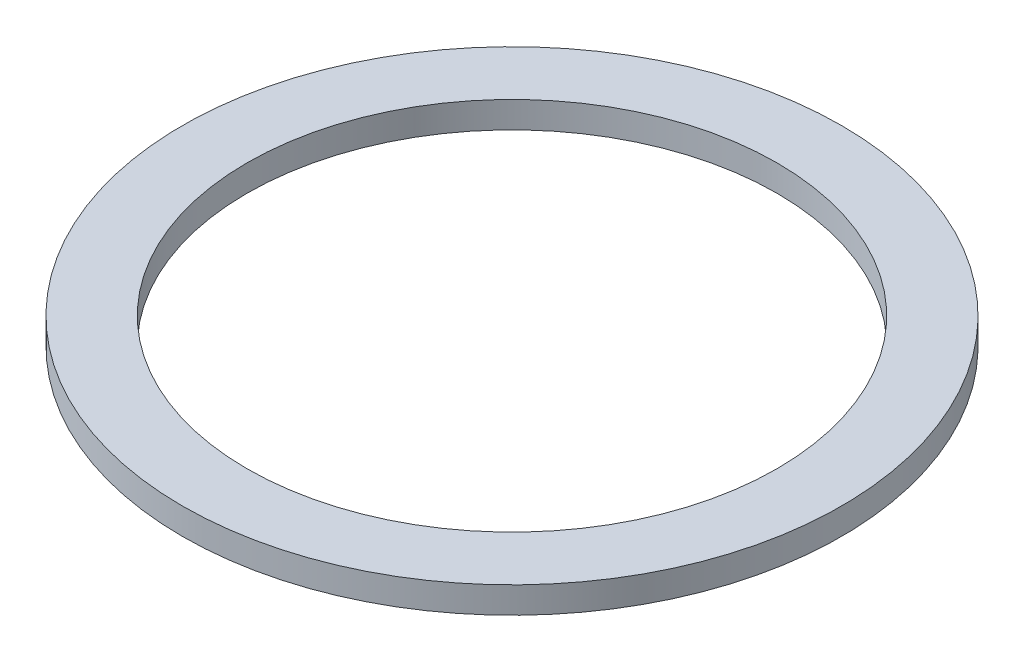
ISO-10303-21;
HEADER;
FILE_DESCRIPTION(('STEP AP214'),'2;1');
FILE_NAME('part.step','',(''),(''),'','','');
FILE_SCHEMA(('AUTOMOTIVE_DESIGN { 1 0 10303 214 1 1 1 1 }'));
ENDSEC;
DATA;
#1=APPLICATION_CONTEXT('core data for automotive mechanical design processes');
#2=APPLICATION_PROTOCOL_DEFINITION('international standard','automotive_design',2000,#1);
#3=PRODUCT_CONTEXT('',#1,'mechanical');
#4=PRODUCT('Part','Part','',(#3));
#5=PRODUCT_RELATED_PRODUCT_CATEGORY('part','',(#4));
#6=PRODUCT_DEFINITION_FORMATION('','',#4);
#7=PRODUCT_DEFINITION_CONTEXT('part definition',#1,'design');
#8=PRODUCT_DEFINITION('design','',#6,#7);
#9=PRODUCT_DEFINITION_SHAPE('','',#8);
#10=(LENGTH_UNIT() NAMED_UNIT(*) SI_UNIT(.MILLI.,.METRE.));
#11=(NAMED_UNIT(*) PLANE_ANGLE_UNIT() SI_UNIT($,.RADIAN.));
#12=(NAMED_UNIT(*) SI_UNIT($,.STERADIAN.) SOLID_ANGLE_UNIT());
#13=UNCERTAINTY_MEASURE_WITH_UNIT(LENGTH_MEASURE(1.E-05),#10,'distance_accuracy_value','');
#14=(GEOMETRIC_REPRESENTATION_CONTEXT(3) GLOBAL_UNCERTAINTY_ASSIGNED_CONTEXT((#13)) GLOBAL_UNIT_ASSIGNED_CONTEXT((#10,
#11,#12)) REPRESENTATION_CONTEXT('',''));
#15=CARTESIAN_POINT('',(0.,0.,0.));
#16=DIRECTION('',(0.,0.,1.));
#17=DIRECTION('',(1.,0.,0.));
#18=AXIS2_PLACEMENT_3D('',#15,#16,#17);
#19=CARTESIAN_POINT('',(0.,1.,0.));
#20=DIRECTION('',(0.,1.,0.));
#21=DIRECTION('',(0.,0.,1.));
#22=AXIS2_PLACEMENT_3D('',#19,#20,#21);
#23=PLANE('',#22);
#24=CARTESIAN_POINT('',(0.,1.,0.));
#25=DIRECTION('',(0.,1.,0.));
#26=DIRECTION('',(0.,0.,1.));
#27=AXIS2_PLACEMENT_3D('',#24,#25,#26);
#28=CIRCLE('',#27,12.5);
#29=CARTESIAN_POINT('',(0.,1.,12.5));
#30=VERTEX_POINT('',#29);
#31=EDGE_CURVE('E10',#30,#30,#28,.T.);
#32=ORIENTED_EDGE('',*,*,#31,.T.);
#33=EDGE_LOOP('',(#32));
#34=FACE_BOUND('',#33,.T.);
#35=CARTESIAN_POINT('',(0.,1.,0.));
#36=DIRECTION('',(0.,1.,0.));
#37=DIRECTION('',(0.,0.,1.));
#38=AXIS2_PLACEMENT_3D('',#35,#36,#37);
#39=CIRCLE('',#38,10.05);
#40=CARTESIAN_POINT('',(0.,1.,10.05));
#41=VERTEX_POINT('',#40);
#42=EDGE_CURVE('E42',#41,#41,#39,.T.);
#43=ORIENTED_EDGE('',*,*,#42,.F.);
#44=EDGE_LOOP('',(#43));
#45=FACE_BOUND('',#44,.T.);
#46=ADVANCED_FACE('F31',(#34,#45),#23,.T.);
#47=CARTESIAN_POINT('',(0.,0.,0.));
#48=DIRECTION('',(0.,1.,0.));
#49=DIRECTION('',(0.,0.,1.));
#50=AXIS2_PLACEMENT_3D('',#47,#48,#49);
#51=PLANE('',#50);
#52=CARTESIAN_POINT('',(0.,0.,0.));
#53=DIRECTION('',(0.,1.,0.));
#54=DIRECTION('',(0.,0.,1.));
#55=AXIS2_PLACEMENT_3D('',#52,#53,#54);
#56=CIRCLE('',#55,12.5);
#57=CARTESIAN_POINT('',(0.,0.,12.5));
#58=VERTEX_POINT('',#57);
#59=EDGE_CURVE('E35',#58,#58,#56,.T.);
#60=ORIENTED_EDGE('',*,*,#59,.F.);
#61=EDGE_LOOP('',(#60));
#62=FACE_BOUND('',#61,.T.);
#63=CARTESIAN_POINT('',(0.,0.,0.));
#64=DIRECTION('',(0.,1.,0.));
#65=DIRECTION('',(0.,0.,1.));
#66=AXIS2_PLACEMENT_3D('',#63,#64,#65);
#67=CIRCLE('',#66,10.05);
#68=CARTESIAN_POINT('',(0.,0.,10.05));
#69=VERTEX_POINT('',#68);
#70=EDGE_CURVE('E44',#69,#69,#67,.T.);
#71=ORIENTED_EDGE('',*,*,#70,.T.);
#72=EDGE_LOOP('',(#71));
#73=FACE_BOUND('',#72,.T.);
#74=ADVANCED_FACE('F54',(#62,#73),#51,.F.);
#75=CARTESIAN_POINT('',(0.,1.,0.));
#76=DIRECTION('',(0.,-1.,0.));
#77=DIRECTION('',(0.,0.,-1.));
#78=AXIS2_PLACEMENT_3D('',#75,#76,#77);
#79=CYLINDRICAL_SURFACE('',#78,12.5);
#80=ORIENTED_EDGE('',*,*,#31,.F.);
#81=EDGE_LOOP('',(#80));
#82=FACE_BOUND('',#81,.T.);
#83=ORIENTED_EDGE('',*,*,#59,.T.);
#84=EDGE_LOOP('',(#83));
#85=FACE_BOUND('',#84,.T.);
#86=ADVANCED_FACE('F33',(#82,#85),#79,.T.);
#87=CARTESIAN_POINT('',(0.,1.,0.));
#88=DIRECTION('',(0.,-1.,0.));
#89=DIRECTION('',(0.,0.,-1.));
#90=AXIS2_PLACEMENT_3D('',#87,#88,#89);
#91=CYLINDRICAL_SURFACE('',#90,10.05);
#92=ORIENTED_EDGE('',*,*,#42,.T.);
#93=EDGE_LOOP('',(#92));
#94=FACE_BOUND('',#93,.T.);
#95=ORIENTED_EDGE('',*,*,#70,.F.);
#96=EDGE_LOOP('',(#95));
#97=FACE_BOUND('',#96,.T.);
#98=ADVANCED_FACE('F50',(#94,#97),#91,.F.);
#99=CLOSED_SHELL('',(#46,#74,#86,#98));
#100=MANIFOLD_SOLID_BREP('B2',#99);
#101=ADVANCED_BREP_SHAPE_REPRESENTATION('',(#18,#100),#14);
#102=SHAPE_DEFINITION_REPRESENTATION(#9,#101);
ENDSEC;
END-ISO-10303-21;
